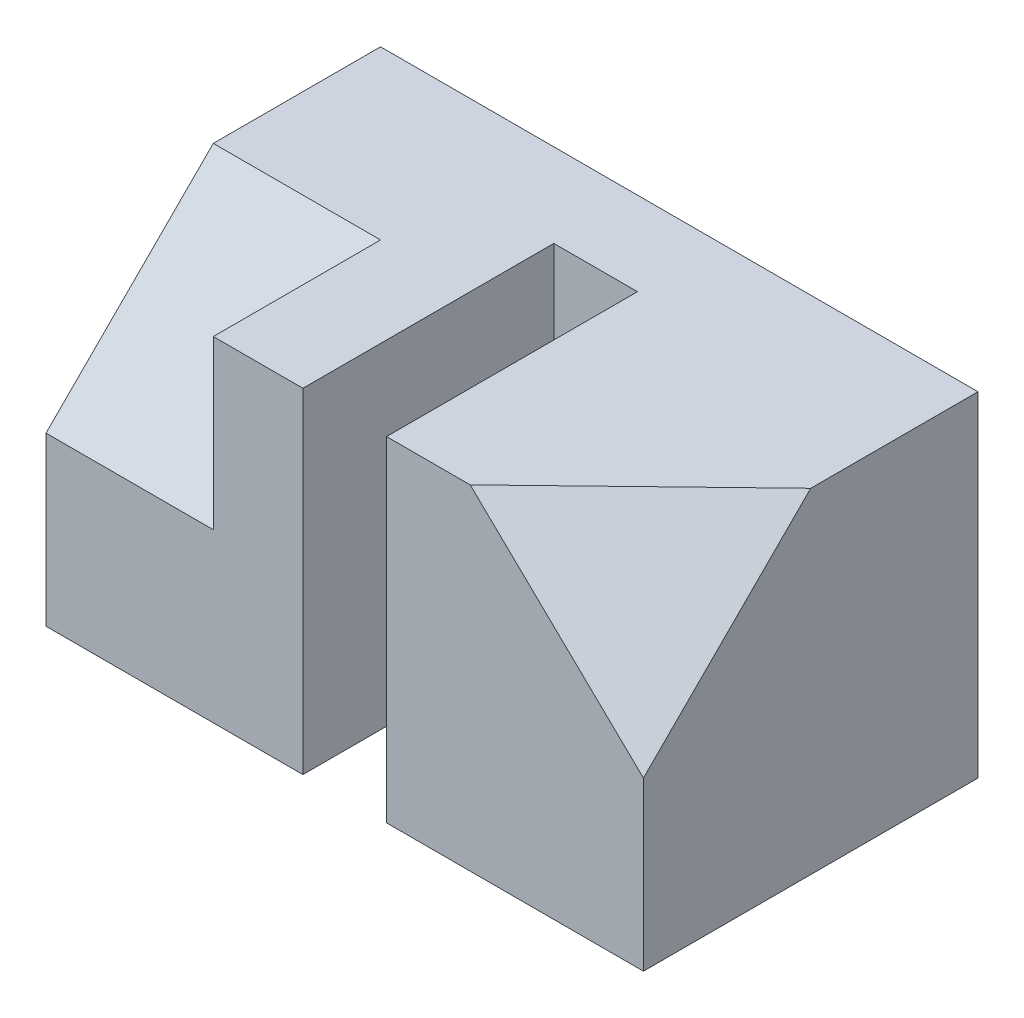
ISO-10303-21;
HEADER;
FILE_DESCRIPTION(('STEP AP214'),'2;1');
FILE_NAME('part.step','',(''),(''),'','','');
FILE_SCHEMA(('AUTOMOTIVE_DESIGN { 1 0 10303 214 1 1 1 1 }'));
ENDSEC;
DATA;
#1=APPLICATION_CONTEXT('core data for automotive mechanical design processes');
#2=APPLICATION_PROTOCOL_DEFINITION('international standard','automotive_design',2000,#1);
#3=PRODUCT_CONTEXT('',#1,'mechanical');
#4=PRODUCT('Part','Part','',(#3));
#5=PRODUCT_RELATED_PRODUCT_CATEGORY('part','',(#4));
#6=PRODUCT_DEFINITION_FORMATION('','',#4);
#7=PRODUCT_DEFINITION_CONTEXT('part definition',#1,'design');
#8=PRODUCT_DEFINITION('design','',#6,#7);
#9=PRODUCT_DEFINITION_SHAPE('','',#8);
#10=(LENGTH_UNIT() NAMED_UNIT(*) SI_UNIT(.MILLI.,.METRE.));
#11=(NAMED_UNIT(*) PLANE_ANGLE_UNIT() SI_UNIT($,.RADIAN.));
#12=(NAMED_UNIT(*) SI_UNIT($,.STERADIAN.) SOLID_ANGLE_UNIT());
#13=UNCERTAINTY_MEASURE_WITH_UNIT(LENGTH_MEASURE(1.E-05),#10,'distance_accuracy_value','');
#14=(GEOMETRIC_REPRESENTATION_CONTEXT(3) GLOBAL_UNCERTAINTY_ASSIGNED_CONTEXT((#13)) GLOBAL_UNIT_ASSIGNED_CONTEXT((#10,
#11,#12)) REPRESENTATION_CONTEXT('',''));
#15=CARTESIAN_POINT('',(0.,0.,0.));
#16=DIRECTION('',(0.,0.,1.));
#17=DIRECTION('',(1.,0.,0.));
#18=AXIS2_PLACEMENT_3D('',#15,#16,#17);
#19=CARTESIAN_POINT('',(0.,28.,0.));
#20=DIRECTION('',(0.,-1.,0.));
#21=DIRECTION('',(0.,0.,-1.));
#22=AXIS2_PLACEMENT_3D('',#19,#20,#21);
#23=PLANE('',#22);
#24=DIRECTION('',(0.,0.,-1.));
#25=VECTOR('',#24,1.);
#26=CARTESIAN_POINT('',(-25.,28.,-7.));
#27=LINE('',#26,#25);
#28=CARTESIAN_POINT('',(-25.,28.,7.));
#29=VERTEX_POINT('',#28);
#30=CARTESIAN_POINT('',(-25.,28.,-7.));
#31=VERTEX_POINT('',#30);
#32=EDGE_CURVE('E138',#29,#31,#27,.T.);
#33=ORIENTED_EDGE('',*,*,#32,.F.);
#34=DIRECTION('',(-1.,0.,0.));
#35=VECTOR('',#34,1.);
#36=CARTESIAN_POINT('',(-11.,28.,7.));
#37=LINE('',#36,#35);
#38=CARTESIAN_POINT('',(-11.,28.,7.));
#39=VERTEX_POINT('',#38);
#40=EDGE_CURVE('E56',#39,#29,#37,.T.);
#41=ORIENTED_EDGE('',*,*,#40,.F.);
#42=DIRECTION('',(0.,0.,-1.));
#43=VECTOR('',#42,1.);
#44=CARTESIAN_POINT('',(-11.,28.,0.));
#45=LINE('',#44,#43);
#46=CARTESIAN_POINT('',(-11.,28.,21.));
#47=VERTEX_POINT('',#46);
#48=EDGE_CURVE('E128',#47,#39,#45,.T.);
#49=ORIENTED_EDGE('',*,*,#48,.F.);
#50=DIRECTION('',(-1.,0.,0.));
#51=VECTOR('',#50,1.);
#52=CARTESIAN_POINT('',(-25.,28.,21.));
#53=LINE('',#52,#51);
#54=CARTESIAN_POINT('',(-3.5,28.,21.));
#55=VERTEX_POINT('',#54);
#56=EDGE_CURVE('E148',#55,#47,#53,.T.);
#57=ORIENTED_EDGE('',*,*,#56,.F.);
#58=DIRECTION('',(0.,0.,1.));
#59=VECTOR('',#58,1.);
#60=CARTESIAN_POINT('',(-3.5,28.,21.));
#61=LINE('',#60,#59);
#62=CARTESIAN_POINT('',(-3.5,28.,0.));
#63=VERTEX_POINT('',#62);
#64=EDGE_CURVE('E145',#63,#55,#61,.T.);
#65=ORIENTED_EDGE('',*,*,#64,.F.);
#66=DIRECTION('',(1.,0.,0.));
#67=VECTOR('',#66,1.);
#68=CARTESIAN_POINT('',(3.5,28.,0.));
#69=LINE('',#68,#67);
#70=CARTESIAN_POINT('',(3.5,28.,0.));
#71=VERTEX_POINT('',#70);
#72=EDGE_CURVE('E171',#63,#71,#69,.T.);
#73=ORIENTED_EDGE('',*,*,#72,.T.);
#74=DIRECTION('',(0.,0.,1.));
#75=VECTOR('',#74,1.);
#76=CARTESIAN_POINT('',(3.5,28.,21.));
#77=LINE('',#76,#75);
#78=CARTESIAN_POINT('',(3.5,28.,21.));
#79=VERTEX_POINT('',#78);
#80=EDGE_CURVE('E174',#71,#79,#77,.T.);
#81=ORIENTED_EDGE('',*,*,#80,.T.);
#82=DIRECTION('',(1.,0.,0.));
#83=VECTOR('',#82,1.);
#84=CARTESIAN_POINT('',(25.,28.,21.));
#85=LINE('',#84,#83);
#86=CARTESIAN_POINT('',(10.5,28.,21.));
#87=VERTEX_POINT('',#86);
#88=EDGE_CURVE('E177',#79,#87,#85,.T.);
#89=ORIENTED_EDGE('',*,*,#88,.T.);
#90=DIRECTION('',(0.719401460617409,0.,-0.694594513699568));
#91=VECTOR('',#90,1.);
#92=CARTESIAN_POINT('',(15.5593846153846,28.,16.1150769230769));
#93=LINE('',#92,#91);
#94=CARTESIAN_POINT('',(25.,28.,6.99999999999997));
#95=VERTEX_POINT('',#94);
#96=EDGE_CURVE('E11',#87,#95,#93,.T.);
#97=ORIENTED_EDGE('',*,*,#96,.T.);
#98=DIRECTION('',(0.,0.,-1.));
#99=VECTOR('',#98,1.);
#100=CARTESIAN_POINT('',(25.,28.,-7.));
#101=LINE('',#100,#99);
#102=CARTESIAN_POINT('',(25.,28.,-7.));
#103=VERTEX_POINT('',#102);
#104=EDGE_CURVE('E180',#95,#103,#101,.T.);
#105=ORIENTED_EDGE('',*,*,#104,.T.);
#106=DIRECTION('',(-1.,0.,0.));
#107=VECTOR('',#106,1.);
#108=CARTESIAN_POINT('',(0.,28.,-7.));
#109=LINE('',#108,#107);
#110=EDGE_CURVE('E182',#103,#31,#109,.T.);
#111=ORIENTED_EDGE('',*,*,#110,.T.);
#112=EDGE_LOOP('',(#33,#41,#49,#57,#65,#73,#81,#89,#97,#105,#111));
#113=FACE_BOUND('',#112,.T.);
#114=ADVANCED_FACE('F41',(#113),#23,.F.);
#115=CARTESIAN_POINT('',(25.,28.,-7.));
#116=DIRECTION('',(-1.,0.,0.));
#117=DIRECTION('',(0.,0.,1.));
#118=AXIS2_PLACEMENT_3D('',#115,#116,#117);
#119=PLANE('',#118);
#120=ORIENTED_EDGE('',*,*,#104,.F.);
#121=DIRECTION('',(0.,-0.707106781186548,0.707106781186548));
#122=VECTOR('',#121,1.);
#123=CARTESIAN_POINT('',(25.,35.,0.));
#124=LINE('',#123,#122);
#125=CARTESIAN_POINT('',(25.,14.,21.));
#126=VERTEX_POINT('',#125);
#127=EDGE_CURVE('E49',#95,#126,#124,.T.);
#128=ORIENTED_EDGE('',*,*,#127,.T.);
#129=DIRECTION('',(0.,-1.,0.));
#130=VECTOR('',#129,1.);
#131=CARTESIAN_POINT('',(25.,28.,21.));
#132=LINE('',#131,#130);
#133=CARTESIAN_POINT('',(25.,0.,21.));
#134=VERTEX_POINT('',#133);
#135=EDGE_CURVE('E197',#126,#134,#132,.T.);
#136=ORIENTED_EDGE('',*,*,#135,.T.);
#137=DIRECTION('',(0.,0.,-1.));
#138=VECTOR('',#137,1.);
#139=CARTESIAN_POINT('',(25.,0.,-7.));
#140=LINE('',#139,#138);
#141=CARTESIAN_POINT('',(25.,0.,-7.));
#142=VERTEX_POINT('',#141);
#143=EDGE_CURVE('E192',#134,#142,#140,.T.);
#144=ORIENTED_EDGE('',*,*,#143,.T.);
#145=DIRECTION('',(0.,-1.,0.));
#146=VECTOR('',#145,1.);
#147=CARTESIAN_POINT('',(25.,28.,-7.));
#148=LINE('',#147,#146);
#149=EDGE_CURVE('E184',#103,#142,#148,.T.);
#150=ORIENTED_EDGE('',*,*,#149,.F.);
#151=EDGE_LOOP('',(#120,#128,#136,#144,#150));
#152=FACE_BOUND('',#151,.T.);
#153=ADVANCED_FACE('F210',(#152),#119,.F.);
#154=CARTESIAN_POINT('',(25.,28.,21.));
#155=DIRECTION('',(0.,0.,-1.));
#156=DIRECTION('',(-1.,0.,0.));
#157=AXIS2_PLACEMENT_3D('',#154,#155,#156);
#158=PLANE('',#157);
#159=ORIENTED_EDGE('',*,*,#135,.F.);
#160=DIRECTION('',(-0.719401460617409,0.694594513699567,0.));
#161=VECTOR('',#160,1.);
#162=CARTESIAN_POINT('',(18.0043076923077,20.7544615384615,21.));
#163=LINE('',#162,#161);
#164=EDGE_CURVE('E205',#126,#87,#163,.T.);
#165=ORIENTED_EDGE('',*,*,#164,.T.);
#166=ORIENTED_EDGE('',*,*,#88,.F.);
#167=DIRECTION('',(0.,-1.,0.));
#168=VECTOR('',#167,1.);
#169=CARTESIAN_POINT('',(3.5,28.,21.));
#170=LINE('',#169,#168);
#171=CARTESIAN_POINT('',(3.5,0.,21.));
#172=VERTEX_POINT('',#171);
#173=EDGE_CURVE('E199',#79,#172,#170,.T.);
#174=ORIENTED_EDGE('',*,*,#173,.T.);
#175=DIRECTION('',(1.,0.,0.));
#176=VECTOR('',#175,1.);
#177=CARTESIAN_POINT('',(25.,0.,21.));
#178=LINE('',#177,#176);
#179=EDGE_CURVE('E189',#172,#134,#178,.T.);
#180=ORIENTED_EDGE('',*,*,#179,.T.);
#181=EDGE_LOOP('',(#159,#165,#166,#174,#180));
#182=FACE_BOUND('',#181,.T.);
#183=ADVANCED_FACE('F213',(#182),#158,.F.);
#184=CARTESIAN_POINT('',(3.5,28.,0.));
#185=DIRECTION('',(0.,0.,-1.));
#186=DIRECTION('',(-1.,0.,0.));
#187=AXIS2_PLACEMENT_3D('',#184,#185,#186);
#188=PLANE('',#187);
#189=DIRECTION('',(1.,0.,0.));
#190=VECTOR('',#189,1.);
#191=CARTESIAN_POINT('',(3.5,0.,0.));
#192=LINE('',#191,#190);
#193=CARTESIAN_POINT('',(-3.5,0.,0.));
#194=VERTEX_POINT('',#193);
#195=CARTESIAN_POINT('',(3.5,0.,0.));
#196=VERTEX_POINT('',#195);
#197=EDGE_CURVE('E170',#194,#196,#192,.T.);
#198=ORIENTED_EDGE('',*,*,#197,.T.);
#199=DIRECTION('',(0.,-1.,0.));
#200=VECTOR('',#199,1.);
#201=CARTESIAN_POINT('',(3.5,28.,0.));
#202=LINE('',#201,#200);
#203=EDGE_CURVE('E202',#71,#196,#202,.T.);
#204=ORIENTED_EDGE('',*,*,#203,.F.);
#205=ORIENTED_EDGE('',*,*,#72,.F.);
#206=DIRECTION('',(0.,-1.,0.));
#207=VECTOR('',#206,1.);
#208=CARTESIAN_POINT('',(-3.5,28.,0.));
#209=LINE('',#208,#207);
#210=EDGE_CURVE('E167',#63,#194,#209,.T.);
#211=ORIENTED_EDGE('',*,*,#210,.T.);
#212=EDGE_LOOP('',(#198,#204,#205,#211));
#213=FACE_BOUND('',#212,.T.);
#214=ADVANCED_FACE('F43',(#213),#188,.F.);
#215=CARTESIAN_POINT('',(3.5,28.,21.));
#216=DIRECTION('',(1.,0.,0.));
#217=DIRECTION('',(0.,0.,-1.));
#218=AXIS2_PLACEMENT_3D('',#215,#216,#217);
#219=PLANE('',#218);
#220=DIRECTION('',(0.,0.,1.));
#221=VECTOR('',#220,1.);
#222=CARTESIAN_POINT('',(3.5,0.,21.));
#223=LINE('',#222,#221);
#224=EDGE_CURVE('E187',#196,#172,#223,.T.);
#225=ORIENTED_EDGE('',*,*,#224,.T.);
#226=ORIENTED_EDGE('',*,*,#173,.F.);
#227=ORIENTED_EDGE('',*,*,#80,.F.);
#228=ORIENTED_EDGE('',*,*,#203,.T.);
#229=EDGE_LOOP('',(#225,#226,#227,#228));
#230=FACE_BOUND('',#229,.T.);
#231=ADVANCED_FACE('F252',(#230),#219,.F.);
#232=CARTESIAN_POINT('',(0.,28.,-7.));
#233=DIRECTION('',(0.,0.,1.));
#234=DIRECTION('',(1.,0.,0.));
#235=AXIS2_PLACEMENT_3D('',#232,#233,#234);
#236=PLANE('',#235);
#237=DIRECTION('',(-1.,0.,0.));
#238=VECTOR('',#237,1.);
#239=CARTESIAN_POINT('',(0.,0.,-7.));
#240=LINE('',#239,#238);
#241=CARTESIAN_POINT('',(-25.,0.,-7.));
#242=VERTEX_POINT('',#241);
#243=EDGE_CURVE('E175',#142,#242,#240,.T.);
#244=ORIENTED_EDGE('',*,*,#243,.T.);
#245=DIRECTION('',(0.,-1.,0.));
#246=VECTOR('',#245,1.);
#247=CARTESIAN_POINT('',(-25.,28.,-7.));
#248=LINE('',#247,#246);
#249=EDGE_CURVE('E152',#31,#242,#248,.T.);
#250=ORIENTED_EDGE('',*,*,#249,.F.);
#251=ORIENTED_EDGE('',*,*,#110,.F.);
#252=ORIENTED_EDGE('',*,*,#149,.T.);
#253=EDGE_LOOP('',(#244,#250,#251,#252));
#254=FACE_BOUND('',#253,.T.);
#255=ADVANCED_FACE('F223',(#254),#236,.F.);
#256=CARTESIAN_POINT('',(0.,0.,0.));
#257=DIRECTION('',(0.,-1.,0.));
#258=DIRECTION('',(0.,0.,-1.));
#259=AXIS2_PLACEMENT_3D('',#256,#257,#258);
#260=PLANE('',#259);
#261=ORIENTED_EDGE('',*,*,#197,.F.);
#262=DIRECTION('',(0.,0.,1.));
#263=VECTOR('',#262,1.);
#264=CARTESIAN_POINT('',(-3.5,0.,21.));
#265=LINE('',#264,#263);
#266=CARTESIAN_POINT('',(-3.5,0.,21.));
#267=VERTEX_POINT('',#266);
#268=EDGE_CURVE('E140',#194,#267,#265,.T.);
#269=ORIENTED_EDGE('',*,*,#268,.T.);
#270=DIRECTION('',(-1.,0.,0.));
#271=VECTOR('',#270,1.);
#272=CARTESIAN_POINT('',(-25.,0.,21.));
#273=LINE('',#272,#271);
#274=CARTESIAN_POINT('',(-25.,0.,21.));
#275=VERTEX_POINT('',#274);
#276=EDGE_CURVE('E155',#267,#275,#273,.T.);
#277=ORIENTED_EDGE('',*,*,#276,.T.);
#278=DIRECTION('',(0.,0.,-1.));
#279=VECTOR('',#278,1.);
#280=CARTESIAN_POINT('',(-25.,0.,-7.));
#281=LINE('',#280,#279);
#282=EDGE_CURVE('E149',#275,#242,#281,.T.);
#283=ORIENTED_EDGE('',*,*,#282,.T.);
#284=ORIENTED_EDGE('',*,*,#243,.F.);
#285=ORIENTED_EDGE('',*,*,#143,.F.);
#286=ORIENTED_EDGE('',*,*,#179,.F.);
#287=ORIENTED_EDGE('',*,*,#224,.F.);
#288=EDGE_LOOP('',(#261,#269,#277,#283,#284,#285,#286,#287));
#289=FACE_BOUND('',#288,.T.);
#290=ADVANCED_FACE('F220',(#289),#260,.T.);
#291=CARTESIAN_POINT('',(-3.5,28.,21.));
#292=DIRECTION('',(-1.,0.,0.));
#293=DIRECTION('',(0.,0.,-1.));
#294=AXIS2_PLACEMENT_3D('',#291,#292,#293);
#295=PLANE('',#294);
#296=ORIENTED_EDGE('',*,*,#268,.F.);
#297=ORIENTED_EDGE('',*,*,#210,.F.);
#298=ORIENTED_EDGE('',*,*,#64,.T.);
#299=DIRECTION('',(0.,-1.,0.));
#300=VECTOR('',#299,1.);
#301=CARTESIAN_POINT('',(-3.5,28.,21.));
#302=LINE('',#301,#300);
#303=EDGE_CURVE('E164',#55,#267,#302,.T.);
#304=ORIENTED_EDGE('',*,*,#303,.T.);
#305=EDGE_LOOP('',(#296,#297,#298,#304));
#306=FACE_BOUND('',#305,.T.);
#307=ADVANCED_FACE('F247',(#306),#295,.F.);
#308=CARTESIAN_POINT('',(-25.,28.,21.));
#309=DIRECTION('',(0.,0.,-1.));
#310=DIRECTION('',(1.,0.,0.));
#311=AXIS2_PLACEMENT_3D('',#308,#309,#310);
#312=PLANE('',#311);
#313=DIRECTION('',(0.,1.,0.));
#314=VECTOR('',#313,1.);
#315=CARTESIAN_POINT('',(-11.,0.,21.));
#316=LINE('',#315,#314);
#317=CARTESIAN_POINT('',(-11.,14.,21.));
#318=VERTEX_POINT('',#317);
#319=EDGE_CURVE('E127',#318,#47,#316,.T.);
#320=ORIENTED_EDGE('',*,*,#319,.F.);
#321=DIRECTION('',(-1.,0.,0.));
#322=VECTOR('',#321,1.);
#323=CARTESIAN_POINT('',(-11.,14.,21.));
#324=LINE('',#323,#322);
#325=CARTESIAN_POINT('',(-25.,14.,21.));
#326=VERTEX_POINT('',#325);
#327=EDGE_CURVE('E124',#318,#326,#324,.T.);
#328=ORIENTED_EDGE('',*,*,#327,.T.);
#329=DIRECTION('',(0.,-1.,0.));
#330=VECTOR('',#329,1.);
#331=CARTESIAN_POINT('',(-25.,28.,21.));
#332=LINE('',#331,#330);
#333=EDGE_CURVE('E162',#326,#275,#332,.T.);
#334=ORIENTED_EDGE('',*,*,#333,.T.);
#335=ORIENTED_EDGE('',*,*,#276,.F.);
#336=ORIENTED_EDGE('',*,*,#303,.F.);
#337=ORIENTED_EDGE('',*,*,#56,.T.);
#338=EDGE_LOOP('',(#320,#328,#334,#335,#336,#337));
#339=FACE_BOUND('',#338,.T.);
#340=ADVANCED_FACE('F236',(#339),#312,.F.);
#341=CARTESIAN_POINT('',(-25.,28.,-7.));
#342=DIRECTION('',(1.,0.,0.));
#343=DIRECTION('',(0.,0.,1.));
#344=AXIS2_PLACEMENT_3D('',#341,#342,#343);
#345=PLANE('',#344);
#346=ORIENTED_EDGE('',*,*,#333,.F.);
#347=DIRECTION('',(0.,-0.707106781186547,0.707106781186548));
#348=VECTOR('',#347,1.);
#349=CARTESIAN_POINT('',(-25.,17.5,17.5));
#350=LINE('',#349,#348);
#351=EDGE_CURVE('E134',#29,#326,#350,.T.);
#352=ORIENTED_EDGE('',*,*,#351,.F.);
#353=ORIENTED_EDGE('',*,*,#32,.T.);
#354=ORIENTED_EDGE('',*,*,#249,.T.);
#355=ORIENTED_EDGE('',*,*,#282,.F.);
#356=EDGE_LOOP('',(#346,#352,#353,#354,#355));
#357=FACE_BOUND('',#356,.T.);
#358=ADVANCED_FACE('F227',(#357),#345,.F.);
#359=CARTESIAN_POINT('',(19.4728304947283,20.1682887266829,20.1682887266829));
#360=DIRECTION('',(-0.563847287108165,-0.583984690219171,-0.583984690219171));
#361=DIRECTION('',(0.,0.707106781186547,-0.707106781186548));
#362=AXIS2_PLACEMENT_3D('',#359,#360,#361);
#363=PLANE('',#362);
#364=ORIENTED_EDGE('',*,*,#164,.F.);
#365=ORIENTED_EDGE('',*,*,#127,.F.);
#366=ORIENTED_EDGE('',*,*,#96,.F.);
#367=EDGE_LOOP('',(#364,#365,#366));
#368=FACE_BOUND('',#367,.T.);
#369=ADVANCED_FACE('F225',(#368),#363,.F.);
#370=CARTESIAN_POINT('',(-11.,17.5,17.5));
#371=DIRECTION('',(0.,-0.707106781186548,-0.707106781186548));
#372=DIRECTION('',(0.,0.707106781186547,-0.707106781186548));
#373=AXIS2_PLACEMENT_3D('',#370,#371,#372);
#374=PLANE('',#373);
#375=ORIENTED_EDGE('',*,*,#351,.T.);
#376=ORIENTED_EDGE('',*,*,#327,.F.);
#377=DIRECTION('',(0.,-0.707106781186547,0.707106781186548));
#378=VECTOR('',#377,1.);
#379=CARTESIAN_POINT('',(-11.,17.5,17.5));
#380=LINE('',#379,#378);
#381=EDGE_CURVE('E120',#39,#318,#380,.T.);
#382=ORIENTED_EDGE('',*,*,#381,.F.);
#383=ORIENTED_EDGE('',*,*,#40,.T.);
#384=EDGE_LOOP('',(#375,#376,#382,#383));
#385=FACE_BOUND('',#384,.T.);
#386=ADVANCED_FACE('F122',(#385),#374,.F.);
#387=CARTESIAN_POINT('',(-11.,0.,0.));
#388=DIRECTION('',(-1.,0.,0.));
#389=DIRECTION('',(0.,0.,1.));
#390=AXIS2_PLACEMENT_3D('',#387,#388,#389);
#391=PLANE('',#390);
#392=ORIENTED_EDGE('',*,*,#48,.T.);
#393=ORIENTED_EDGE('',*,*,#381,.T.);
#394=ORIENTED_EDGE('',*,*,#319,.T.);
#395=EDGE_LOOP('',(#392,#393,#394));
#396=FACE_BOUND('',#395,.T.);
#397=ADVANCED_FACE('F131',(#396),#391,.T.);
#398=CLOSED_SHELL('',(#114,#153,#183,#214,#231,#255,#290,#307,#340,#358,#369,#386,#397));
#399=MANIFOLD_SOLID_BREP('B2',#398);
#400=ADVANCED_BREP_SHAPE_REPRESENTATION('',(#18,#399),#14);
#401=SHAPE_DEFINITION_REPRESENTATION(#9,#400);
ENDSEC;
END-ISO-10303-21;
